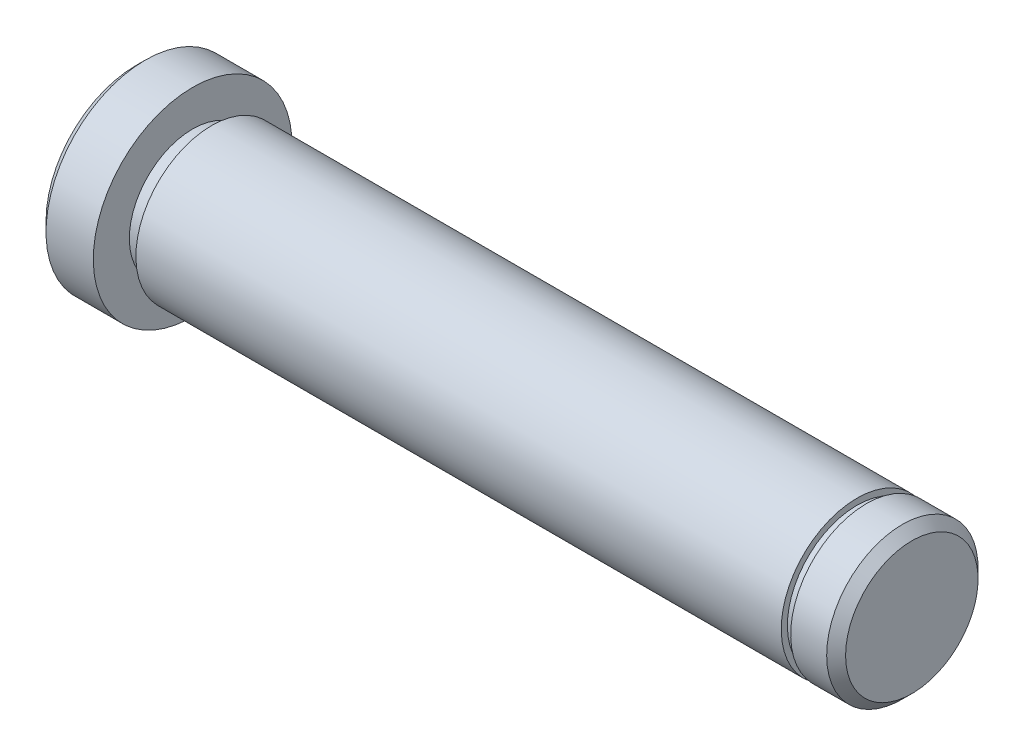
ISO-10303-21;
HEADER;
FILE_DESCRIPTION(('STEP AP214'),'2;1');
FILE_NAME('part.step','',(''),(''),'','','');
FILE_SCHEMA(('AUTOMOTIVE_DESIGN { 1 0 10303 214 1 1 1 1 }'));
ENDSEC;
DATA;
#1=APPLICATION_CONTEXT('core data for automotive mechanical design processes');
#2=APPLICATION_PROTOCOL_DEFINITION('international standard','automotive_design',2000,#1);
#3=PRODUCT_CONTEXT('',#1,'mechanical');
#4=PRODUCT('Part','Part','',(#3));
#5=PRODUCT_RELATED_PRODUCT_CATEGORY('part','',(#4));
#6=PRODUCT_DEFINITION_FORMATION('','',#4);
#7=PRODUCT_DEFINITION_CONTEXT('part definition',#1,'design');
#8=PRODUCT_DEFINITION('design','',#6,#7);
#9=PRODUCT_DEFINITION_SHAPE('','',#8);
#10=(LENGTH_UNIT() NAMED_UNIT(*) SI_UNIT(.MILLI.,.METRE.));
#11=(NAMED_UNIT(*) PLANE_ANGLE_UNIT() SI_UNIT($,.RADIAN.));
#12=(NAMED_UNIT(*) SI_UNIT($,.STERADIAN.) SOLID_ANGLE_UNIT());
#13=UNCERTAINTY_MEASURE_WITH_UNIT(LENGTH_MEASURE(1.E-05),#10,'distance_accuracy_value','');
#14=(GEOMETRIC_REPRESENTATION_CONTEXT(3) GLOBAL_UNCERTAINTY_ASSIGNED_CONTEXT((#13)) GLOBAL_UNIT_ASSIGNED_CONTEXT((#10,
#11,#12)) REPRESENTATION_CONTEXT('',''));
#15=CARTESIAN_POINT('',(0.,0.,0.));
#16=DIRECTION('',(0.,0.,1.));
#17=DIRECTION('',(1.,0.,0.));
#18=AXIS2_PLACEMENT_3D('',#15,#16,#17);
#19=CARTESIAN_POINT('',(0.,0.,0.));
#20=DIRECTION('',(1.,0.,0.));
#21=DIRECTION('',(0.,1.,0.));
#22=AXIS2_PLACEMENT_3D('',#19,#20,#21);
#23=PLANE('',#22);
#24=CARTESIAN_POINT('',(0.,0.,0.));
#25=DIRECTION('',(1.,0.,0.));
#26=DIRECTION('',(0.,0.,-1.));
#27=AXIS2_PLACEMENT_3D('',#24,#25,#26);
#28=CIRCLE('',#27,9.5);
#29=CARTESIAN_POINT('',(0.,0.,-9.5));
#30=VERTEX_POINT('',#29);
#31=EDGE_CURVE('E17',#30,#30,#28,.T.);
#32=ORIENTED_EDGE('',*,*,#31,.F.);
#33=EDGE_LOOP('',(#32));
#34=FACE_BOUND('',#33,.T.);
#35=ADVANCED_FACE('F14',(#34),#23,.F.);
#36=CARTESIAN_POINT('',(82.,0.,0.));
#37=DIRECTION('',(-1.,0.,0.));
#38=DIRECTION('',(0.,-1.,0.));
#39=AXIS2_PLACEMENT_3D('',#36,#37,#38);
#40=PLANE('',#39);
#41=CARTESIAN_POINT('',(81.9999999999936,0.,0.));
#42=DIRECTION('',(-1.,0.,0.));
#43=DIRECTION('',(0.,0.,1.));
#44=AXIS2_PLACEMENT_3D('',#41,#42,#43);
#45=CIRCLE('',#44,6.99999999994816);
#46=CARTESIAN_POINT('',(81.9999999999936,0.,6.99999999994816));
#47=VERTEX_POINT('',#46);
#48=EDGE_CURVE('E49',#47,#47,#45,.T.);
#49=ORIENTED_EDGE('',*,*,#48,.F.);
#50=EDGE_LOOP('',(#49));
#51=FACE_BOUND('',#50,.T.);
#52=ADVANCED_FACE('F60',(#51),#40,.F.);
#53=CARTESIAN_POINT('',(0.999999999999989,0.,0.));
#54=DIRECTION('',(1.,0.,0.));
#55=DIRECTION('',(0.,0.,-1.));
#56=AXIS2_PLACEMENT_3D('',#53,#54,#55);
#57=CONICAL_SURFACE('',#56,10.5,0.785398163397454);
#58=CARTESIAN_POINT('',(0.999999999999987,0.,0.));
#59=DIRECTION('',(1.,0.,0.));
#60=DIRECTION('',(0.,1.,0.));
#61=AXIS2_PLACEMENT_3D('',#58,#59,#60);
#62=CIRCLE('',#61,10.5);
#63=CARTESIAN_POINT('',(0.999999999999987,10.5,0.));
#64=VERTEX_POINT('',#63);
#65=EDGE_CURVE('E29',#64,#64,#62,.T.);
#66=ORIENTED_EDGE('',*,*,#65,.F.);
#67=EDGE_LOOP('',(#66));
#68=FACE_BOUND('',#67,.T.);
#69=ORIENTED_EDGE('',*,*,#31,.T.);
#70=EDGE_LOOP('',(#69));
#71=FACE_BOUND('',#70,.T.);
#72=ADVANCED_FACE('F57',(#68,#71),#57,.T.);
#73=CARTESIAN_POINT('',(81.0000000000741,0.,0.));
#74=DIRECTION('',(-1.,0.,0.));
#75=DIRECTION('',(0.,0.,1.));
#76=AXIS2_PLACEMENT_3D('',#73,#74,#75);
#77=CONICAL_SURFACE('',#76,7.99999999986767,0.785398163397448);
#78=CARTESIAN_POINT('',(81.,0.,0.));
#79=DIRECTION('',(1.,0.,0.));
#80=DIRECTION('',(0.,1.,0.));
#81=AXIS2_PLACEMENT_3D('',#78,#79,#80);
#82=CIRCLE('',#81,8.);
#83=CARTESIAN_POINT('',(81.,8.,0.));
#84=VERTEX_POINT('',#83);
#85=EDGE_CURVE('E48',#84,#84,#82,.F.);
#86=ORIENTED_EDGE('',*,*,#85,.F.);
#87=EDGE_LOOP('',(#86));
#88=FACE_BOUND('',#87,.T.);
#89=ORIENTED_EDGE('',*,*,#48,.T.);
#90=EDGE_LOOP('',(#89));
#91=FACE_BOUND('',#90,.T.);
#92=ADVANCED_FACE('F105',(#88,#91),#77,.T.);
#93=CARTESIAN_POINT('',(82.,0.,0.));
#94=DIRECTION('',(1.,0.,0.));
#95=DIRECTION('',(0.,1.,0.));
#96=AXIS2_PLACEMENT_3D('',#93,#94,#95);
#97=CYLINDRICAL_SURFACE('',#96,10.5);
#98=CARTESIAN_POINT('',(6.00000000000001,0.,0.));
#99=DIRECTION('',(1.,0.,0.));
#100=DIRECTION('',(0.,1.,0.));
#101=AXIS2_PLACEMENT_3D('',#98,#99,#100);
#102=CIRCLE('',#101,10.5);
#103=CARTESIAN_POINT('',(6.00000000000001,10.5,0.));
#104=VERTEX_POINT('',#103);
#105=EDGE_CURVE('E46',#104,#104,#102,.F.);
#106=ORIENTED_EDGE('',*,*,#105,.T.);
#107=EDGE_LOOP('',(#106));
#108=FACE_BOUND('',#107,.T.);
#109=ORIENTED_EDGE('',*,*,#65,.T.);
#110=EDGE_LOOP('',(#109));
#111=FACE_BOUND('',#110,.T.);
#112=ADVANCED_FACE('F101',(#108,#111),#97,.T.);
#113=CARTESIAN_POINT('',(82.,0.,0.));
#114=DIRECTION('',(1.,0.,0.));
#115=DIRECTION('',(0.,1.,0.));
#116=AXIS2_PLACEMENT_3D('',#113,#114,#115);
#117=CYLINDRICAL_SURFACE('',#116,8.);
#118=ORIENTED_EDGE('',*,*,#85,.T.);
#119=EDGE_LOOP('',(#118));
#120=FACE_BOUND('',#119,.T.);
#121=CARTESIAN_POINT('',(77.2,0.,0.));
#122=DIRECTION('',(1.,0.,0.));
#123=DIRECTION('',(0.,1.,0.));
#124=AXIS2_PLACEMENT_3D('',#121,#122,#123);
#125=CIRCLE('',#124,8.);
#126=CARTESIAN_POINT('',(77.2,8.,0.));
#127=VERTEX_POINT('',#126);
#128=EDGE_CURVE('E43',#127,#127,#125,.T.);
#129=ORIENTED_EDGE('',*,*,#128,.T.);
#130=EDGE_LOOP('',(#129));
#131=FACE_BOUND('',#130,.T.);
#132=ADVANCED_FACE('F97',(#120,#131),#117,.T.);
#133=CARTESIAN_POINT('',(6.,0.,0.));
#134=DIRECTION('',(-1.,0.,0.));
#135=DIRECTION('',(0.,-1.,0.));
#136=AXIS2_PLACEMENT_3D('',#133,#134,#135);
#137=PLANE('',#136);
#138=ORIENTED_EDGE('',*,*,#105,.F.);
#139=EDGE_LOOP('',(#138));
#140=FACE_BOUND('',#139,.T.);
#141=CARTESIAN_POINT('',(6.00000000000001,0.,0.));
#142=DIRECTION('',(1.,0.,0.));
#143=DIRECTION('',(0.,1.,0.));
#144=AXIS2_PLACEMENT_3D('',#141,#142,#143);
#145=CIRCLE('',#144,6.691876128);
#146=CARTESIAN_POINT('',(6.00000000000001,6.691876128,0.));
#147=VERTEX_POINT('',#146);
#148=EDGE_CURVE('E40',#147,#147,#145,.T.);
#149=ORIENTED_EDGE('',*,*,#148,.F.);
#150=EDGE_LOOP('',(#149));
#151=FACE_BOUND('',#150,.T.);
#152=ADVANCED_FACE('F93',(#140,#151),#137,.F.);
#153=CARTESIAN_POINT('',(77.2,0.,0.));
#154=DIRECTION('',(1.,0.,0.));
#155=DIRECTION('',(0.,1.,0.));
#156=AXIS2_PLACEMENT_3D('',#153,#154,#155);
#157=PLANE('',#156);
#158=CARTESIAN_POINT('',(77.2,0.,0.));
#159=DIRECTION('',(1.,0.,0.));
#160=DIRECTION('',(0.,1.,0.));
#161=AXIS2_PLACEMENT_3D('',#158,#159,#160);
#162=CIRCLE('',#161,7.35);
#163=CARTESIAN_POINT('',(77.2,7.35,0.));
#164=VERTEX_POINT('',#163);
#165=EDGE_CURVE('E37',#164,#164,#162,.F.);
#166=ORIENTED_EDGE('',*,*,#165,.F.);
#167=EDGE_LOOP('',(#166));
#168=FACE_BOUND('',#167,.T.);
#169=ORIENTED_EDGE('',*,*,#128,.F.);
#170=EDGE_LOOP('',(#169));
#171=FACE_BOUND('',#170,.T.);
#172=ADVANCED_FACE('F89',(#168,#171),#157,.F.);
#173=CARTESIAN_POINT('',(82.,0.,0.));
#174=DIRECTION('',(1.,0.,0.));
#175=DIRECTION('',(0.,1.,0.));
#176=AXIS2_PLACEMENT_3D('',#173,#174,#175);
#177=CYLINDRICAL_SURFACE('',#176,6.691876128);
#178=CARTESIAN_POINT('',(7.99999999999999,0.,0.));
#179=DIRECTION('',(1.,0.,0.));
#180=DIRECTION('',(0.,1.,0.));
#181=AXIS2_PLACEMENT_3D('',#178,#179,#180);
#182=CIRCLE('',#181,6.691876128);
#183=CARTESIAN_POINT('',(7.99999999999999,6.691876128,0.));
#184=VERTEX_POINT('',#183);
#185=EDGE_CURVE('E34',#184,#184,#182,.F.);
#186=ORIENTED_EDGE('',*,*,#185,.T.);
#187=EDGE_LOOP('',(#186));
#188=FACE_BOUND('',#187,.T.);
#189=ORIENTED_EDGE('',*,*,#148,.T.);
#190=EDGE_LOOP('',(#189));
#191=FACE_BOUND('',#190,.T.);
#192=ADVANCED_FACE('F85',(#188,#191),#177,.T.);
#193=CARTESIAN_POINT('',(82.,0.,0.));
#194=DIRECTION('',(1.,0.,0.));
#195=DIRECTION('',(0.,1.,0.));
#196=AXIS2_PLACEMENT_3D('',#193,#194,#195);
#197=CYLINDRICAL_SURFACE('',#196,7.35);
#198=ORIENTED_EDGE('',*,*,#165,.T.);
#199=EDGE_LOOP('',(#198));
#200=FACE_BOUND('',#199,.T.);
#201=CARTESIAN_POINT('',(76.2,0.,0.));
#202=DIRECTION('',(1.,0.,0.));
#203=DIRECTION('',(0.,1.,0.));
#204=AXIS2_PLACEMENT_3D('',#201,#202,#203);
#205=CIRCLE('',#204,7.35);
#206=CARTESIAN_POINT('',(76.2,7.35,0.));
#207=VERTEX_POINT('',#206);
#208=EDGE_CURVE('E26',#207,#207,#205,.T.);
#209=ORIENTED_EDGE('',*,*,#208,.T.);
#210=EDGE_LOOP('',(#209));
#211=FACE_BOUND('',#210,.T.);
#212=ADVANCED_FACE('F81',(#200,#211),#197,.T.);
#213=CARTESIAN_POINT('',(8.,0.,0.));
#214=DIRECTION('',(1.,0.,0.));
#215=DIRECTION('',(0.,1.,0.));
#216=AXIS2_PLACEMENT_3D('',#213,#214,#215);
#217=PLANE('',#216);
#218=ORIENTED_EDGE('',*,*,#185,.F.);
#219=EDGE_LOOP('',(#218));
#220=FACE_BOUND('',#219,.T.);
#221=CARTESIAN_POINT('',(7.99999999999999,0.,0.));
#222=DIRECTION('',(1.,0.,0.));
#223=DIRECTION('',(0.,1.,0.));
#224=AXIS2_PLACEMENT_3D('',#221,#222,#223);
#225=CIRCLE('',#224,8.);
#226=CARTESIAN_POINT('',(7.99999999999999,8.,0.));
#227=VERTEX_POINT('',#226);
#228=EDGE_CURVE('E21',#227,#227,#225,.T.);
#229=ORIENTED_EDGE('',*,*,#228,.F.);
#230=EDGE_LOOP('',(#229));
#231=FACE_BOUND('',#230,.T.);
#232=ADVANCED_FACE('F74',(#220,#231),#217,.F.);
#233=CARTESIAN_POINT('',(76.2,0.,0.));
#234=DIRECTION('',(-1.,0.,0.));
#235=DIRECTION('',(0.,-1.,0.));
#236=AXIS2_PLACEMENT_3D('',#233,#234,#235);
#237=PLANE('',#236);
#238=CARTESIAN_POINT('',(76.2,0.,0.));
#239=DIRECTION('',(1.,0.,0.));
#240=DIRECTION('',(0.,1.,0.));
#241=AXIS2_PLACEMENT_3D('',#238,#239,#240);
#242=CIRCLE('',#241,8.);
#243=CARTESIAN_POINT('',(76.2,8.,0.));
#244=VERTEX_POINT('',#243);
#245=EDGE_CURVE('E10',#244,#244,#242,.F.);
#246=ORIENTED_EDGE('',*,*,#245,.F.);
#247=EDGE_LOOP('',(#246));
#248=FACE_BOUND('',#247,.T.);
#249=ORIENTED_EDGE('',*,*,#208,.F.);
#250=EDGE_LOOP('',(#249));
#251=FACE_BOUND('',#250,.T.);
#252=ADVANCED_FACE('F68',(#248,#251),#237,.F.);
#253=CARTESIAN_POINT('',(82.,0.,0.));
#254=DIRECTION('',(1.,0.,0.));
#255=DIRECTION('',(0.,1.,0.));
#256=AXIS2_PLACEMENT_3D('',#253,#254,#255);
#257=CYLINDRICAL_SURFACE('',#256,8.);
#258=ORIENTED_EDGE('',*,*,#245,.T.);
#259=EDGE_LOOP('',(#258));
#260=FACE_BOUND('',#259,.T.);
#261=ORIENTED_EDGE('',*,*,#228,.T.);
#262=EDGE_LOOP('',(#261));
#263=FACE_BOUND('',#262,.T.);
#264=ADVANCED_FACE('F66',(#260,#263),#257,.T.);
#265=CLOSED_SHELL('',(#35,#52,#72,#92,#112,#132,#152,#172,#192,#212,#232,#252,#264));
#266=MANIFOLD_SOLID_BREP('B1',#265);
#267=ADVANCED_BREP_SHAPE_REPRESENTATION('',(#18,#266),#14);
#268=SHAPE_DEFINITION_REPRESENTATION(#9,#267);
ENDSEC;
END-ISO-10303-21;
